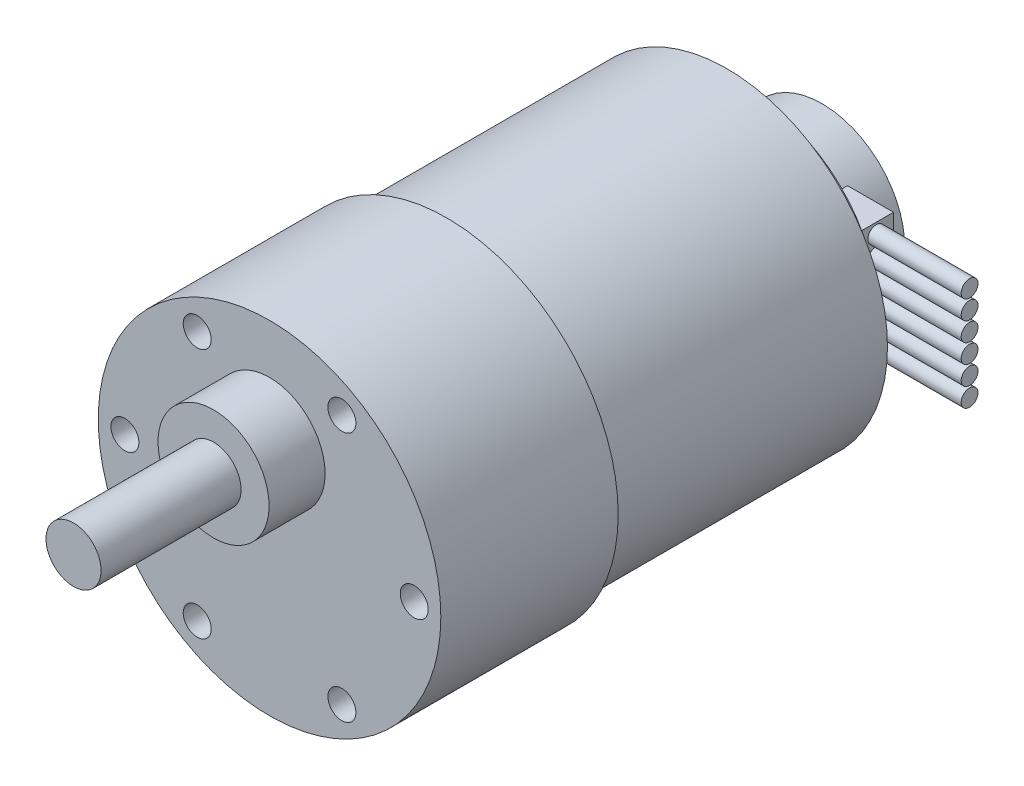
ISO-10303-21;
HEADER;
FILE_DESCRIPTION(('STEP AP214'),'2;1');
FILE_NAME('part.step','',(''),(''),'','','');
FILE_SCHEMA(('AUTOMOTIVE_DESIGN { 1 0 10303 214 1 1 1 1 }'));
ENDSEC;
DATA;
#1=APPLICATION_CONTEXT('core data for automotive mechanical design processes');
#2=APPLICATION_PROTOCOL_DEFINITION('international standard','automotive_design',2000,#1);
#3=PRODUCT_CONTEXT('',#1,'mechanical');
#4=PRODUCT('Part','Part','',(#3));
#5=PRODUCT_RELATED_PRODUCT_CATEGORY('part','',(#4));
#6=PRODUCT_DEFINITION_FORMATION('','',#4);
#7=PRODUCT_DEFINITION_CONTEXT('part definition',#1,'design');
#8=PRODUCT_DEFINITION('design','',#6,#7);
#9=PRODUCT_DEFINITION_SHAPE('','',#8);
#10=(LENGTH_UNIT() NAMED_UNIT(*) SI_UNIT(.MILLI.,.METRE.));
#11=(NAMED_UNIT(*) PLANE_ANGLE_UNIT() SI_UNIT($,.RADIAN.));
#12=(NAMED_UNIT(*) SI_UNIT($,.STERADIAN.) SOLID_ANGLE_UNIT());
#13=UNCERTAINTY_MEASURE_WITH_UNIT(LENGTH_MEASURE(1.E-05),#10,'distance_accuracy_value','');
#14=(GEOMETRIC_REPRESENTATION_CONTEXT(3) GLOBAL_UNCERTAINTY_ASSIGNED_CONTEXT((#13)) GLOBAL_UNIT_ASSIGNED_CONTEXT((#10,
#11,#12)) REPRESENTATION_CONTEXT('',''));
#15=CARTESIAN_POINT('',(0.,0.,0.));
#16=DIRECTION('',(0.,0.,1.));
#17=DIRECTION('',(1.,0.,0.));
#18=AXIS2_PLACEMENT_3D('',#15,#16,#17);
#19=CARTESIAN_POINT('',(0.,0.,-32.9));
#20=DIRECTION('',(0.,0.,-1.));
#21=DIRECTION('',(-1.,0.,0.));
#22=AXIS2_PLACEMENT_3D('',#19,#20,#21);
#23=PLANE('',#22);
#24=CARTESIAN_POINT('',(0.,0.,-32.9));
#25=DIRECTION('',(0.,0.,-1.));
#26=DIRECTION('',(-1.,0.,0.));
#27=AXIS2_PLACEMENT_3D('',#24,#25,#26);
#28=CIRCLE('',#27,13.25);
#29=CARTESIAN_POINT('',(-13.25,0.,-32.9));
#30=VERTEX_POINT('',#29);
#31=EDGE_CURVE('E129',#30,#30,#28,.T.);
#32=ORIENTED_EDGE('',*,*,#31,.T.);
#33=EDGE_LOOP('',(#32));
#34=FACE_BOUND('',#33,.T.);
#35=CARTESIAN_POINT('',(0.,0.,-32.9));
#36=DIRECTION('',(0.,0.,-1.));
#37=DIRECTION('',(-1.,0.,0.));
#38=AXIS2_PLACEMENT_3D('',#35,#36,#37);
#39=CIRCLE('',#38,8.85);
#40=CARTESIAN_POINT('',(6.31525929792277,6.2,-32.9));
#41=VERTEX_POINT('',#40);
#42=CARTESIAN_POINT('',(6.31525929792277,-6.2,-32.9));
#43=VERTEX_POINT('',#42);
#44=EDGE_CURVE('E128',#41,#43,#39,.F.);
#45=ORIENTED_EDGE('',*,*,#44,.T.);
#46=DIRECTION('',(1.,0.,0.));
#47=VECTOR('',#46,1.);
#48=CARTESIAN_POINT('',(0.,-6.2,-32.9));
#49=LINE('',#48,#47);
#50=CARTESIAN_POINT('',(11.25,-6.2,-32.9));
#51=VERTEX_POINT('',#50);
#52=EDGE_CURVE('E80',#43,#51,#49,.T.);
#53=ORIENTED_EDGE('',*,*,#52,.T.);
#54=DIRECTION('',(0.,1.,0.));
#55=VECTOR('',#54,1.);
#56=CARTESIAN_POINT('',(11.25,0.,-32.9));
#57=LINE('',#56,#55);
#58=CARTESIAN_POINT('',(11.25,6.2,-32.9));
#59=VERTEX_POINT('',#58);
#60=EDGE_CURVE('E115',#51,#59,#57,.T.);
#61=ORIENTED_EDGE('',*,*,#60,.T.);
#62=DIRECTION('',(-1.,0.,0.));
#63=VECTOR('',#62,1.);
#64=CARTESIAN_POINT('',(0.,6.2,-32.9));
#65=LINE('',#64,#63);
#66=EDGE_CURVE('E116',#59,#41,#65,.T.);
#67=ORIENTED_EDGE('',*,*,#66,.T.);
#68=EDGE_LOOP('',(#45,#53,#61,#67));
#69=FACE_BOUND('',#68,.T.);
#70=ADVANCED_FACE('F58',(#34,#69),#23,.T.);
#71=CARTESIAN_POINT('',(0.,0.,-40.2));
#72=DIRECTION('',(0.,0.,1.));
#73=DIRECTION('',(1.,0.,0.));
#74=AXIS2_PLACEMENT_3D('',#71,#72,#73);
#75=CYLINDRICAL_SURFACE('',#74,8.85);
#76=CARTESIAN_POINT('',(0.,0.,-40.2));
#77=DIRECTION('',(0.,0.,-1.));
#78=DIRECTION('',(-1.,0.,0.));
#79=AXIS2_PLACEMENT_3D('',#76,#77,#78);
#80=CIRCLE('',#79,8.85);
#81=CARTESIAN_POINT('',(-8.85,0.,-40.2));
#82=VERTEX_POINT('',#81);
#83=EDGE_CURVE('E125',#82,#82,#80,.T.);
#84=ORIENTED_EDGE('',*,*,#83,.F.);
#85=EDGE_LOOP('',(#84));
#86=FACE_BOUND('',#85,.T.);
#87=DIRECTION('',(0.,0.,1.));
#88=VECTOR('',#87,1.);
#89=CARTESIAN_POINT('',(6.31525929792277,-6.2,-40.2));
#90=LINE('',#89,#88);
#91=CARTESIAN_POINT('',(6.31525929792277,-6.2,-36.6));
#92=VERTEX_POINT('',#91);
#93=EDGE_CURVE('E100',#43,#92,#90,.F.);
#94=ORIENTED_EDGE('',*,*,#93,.F.);
#95=ORIENTED_EDGE('',*,*,#44,.F.);
#96=DIRECTION('',(0.,0.,1.));
#97=VECTOR('',#96,1.);
#98=CARTESIAN_POINT('',(6.31525929792277,6.2,-40.2));
#99=LINE('',#98,#97);
#100=CARTESIAN_POINT('',(6.31525929792277,6.2,-36.6));
#101=VERTEX_POINT('',#100);
#102=EDGE_CURVE('E199',#101,#41,#99,.T.);
#103=ORIENTED_EDGE('',*,*,#102,.F.);
#104=CARTESIAN_POINT('',(0.,0.,-36.6));
#105=DIRECTION('',(0.,0.,-1.));
#106=DIRECTION('',(-1.,0.,0.));
#107=AXIS2_PLACEMENT_3D('',#104,#105,#106);
#108=CIRCLE('',#107,8.85);
#109=EDGE_CURVE('E136',#101,#92,#108,.T.);
#110=ORIENTED_EDGE('',*,*,#109,.T.);
#111=EDGE_LOOP('',(#94,#95,#103,#110));
#112=FACE_BOUND('',#111,.T.);
#113=ADVANCED_FACE('F248',(#86,#112),#75,.T.);
#114=CARTESIAN_POINT('',(0.,0.,0.));
#115=DIRECTION('',(0.,0.,1.));
#116=DIRECTION('',(1.,0.,0.));
#117=AXIS2_PLACEMENT_3D('',#114,#115,#116);
#118=PLANE('',#117);
#119=CARTESIAN_POINT('',(0.,0.,0.));
#120=DIRECTION('',(0.,0.,1.));
#121=DIRECTION('',(1.,0.,0.));
#122=AXIS2_PLACEMENT_3D('',#119,#120,#121);
#123=CIRCLE('',#122,17.2);
#124=CARTESIAN_POINT('',(17.2,0.,0.));
#125=VERTEX_POINT('',#124);
#126=EDGE_CURVE('E181',#125,#125,#123,.T.);
#127=ORIENTED_EDGE('',*,*,#126,.T.);
#128=EDGE_LOOP('',(#127));
#129=FACE_BOUND('',#128,.T.);
#130=CARTESIAN_POINT('',(0.,0.,0.));
#131=DIRECTION('',(0.,0.,1.));
#132=DIRECTION('',(1.,0.,0.));
#133=AXIS2_PLACEMENT_3D('',#130,#131,#132);
#134=CIRCLE('',#133,18.35);
#135=CARTESIAN_POINT('',(18.35,0.,0.));
#136=VERTEX_POINT('',#135);
#137=EDGE_CURVE('E187',#136,#136,#134,.T.);
#138=ORIENTED_EDGE('',*,*,#137,.F.);
#139=EDGE_LOOP('',(#138));
#140=FACE_BOUND('',#139,.T.);
#141=ADVANCED_FACE('F254',(#129,#140),#118,.F.);
#142=CARTESIAN_POINT('',(0.,0.,19.));
#143=DIRECTION('',(0.,0.,-1.));
#144=DIRECTION('',(-1.,0.,0.));
#145=AXIS2_PLACEMENT_3D('',#142,#143,#144);
#146=CYLINDRICAL_SURFACE('',#145,18.35);
#147=CARTESIAN_POINT('',(0.,0.,19.));
#148=DIRECTION('',(0.,0.,1.));
#149=DIRECTION('',(1.,0.,0.));
#150=AXIS2_PLACEMENT_3D('',#147,#148,#149);
#151=CIRCLE('',#150,18.35);
#152=CARTESIAN_POINT('',(18.35,0.,19.));
#153=VERTEX_POINT('',#152);
#154=EDGE_CURVE('E137',#153,#153,#151,.T.);
#155=ORIENTED_EDGE('',*,*,#154,.F.);
#156=EDGE_LOOP('',(#155));
#157=FACE_BOUND('',#156,.T.);
#158=ORIENTED_EDGE('',*,*,#137,.T.);
#159=EDGE_LOOP('',(#158));
#160=FACE_BOUND('',#159,.T.);
#161=ADVANCED_FACE('F60',(#157,#160),#146,.T.);
#162=CARTESIAN_POINT('',(0.,0.,19.));
#163=DIRECTION('',(0.,0.,1.));
#164=DIRECTION('',(1.,0.,0.));
#165=AXIS2_PLACEMENT_3D('',#162,#163,#164);
#166=PLANE('',#165);
#167=CARTESIAN_POINT('',(0.,7.1,19.));
#168=DIRECTION('',(0.,0.,1.));
#169=DIRECTION('',(1.,0.,0.));
#170=AXIS2_PLACEMENT_3D('',#167,#168,#169);
#171=CIRCLE('',#170,5.95);
#172=CARTESIAN_POINT('',(5.95,7.1,19.));
#173=VERTEX_POINT('',#172);
#174=EDGE_CURVE('E145',#173,#173,#171,.T.);
#175=ORIENTED_EDGE('',*,*,#174,.F.);
#176=EDGE_LOOP('',(#175));
#177=FACE_BOUND('',#176,.T.);
#178=CARTESIAN_POINT('',(-15.5,0.,19.));
#179=DIRECTION('',(0.,0.,1.));
#180=DIRECTION('',(1.,0.,0.));
#181=AXIS2_PLACEMENT_3D('',#178,#179,#180);
#182=CIRCLE('',#181,1.5);
#183=CARTESIAN_POINT('',(-14.,0.,19.));
#184=VERTEX_POINT('',#183);
#185=EDGE_CURVE('E144',#184,#184,#182,.T.);
#186=ORIENTED_EDGE('',*,*,#185,.F.);
#187=EDGE_LOOP('',(#186));
#188=FACE_BOUND('',#187,.T.);
#189=CARTESIAN_POINT('',(-7.75,-13.4233937586588,19.));
#190=DIRECTION('',(0.,0.,1.));
#191=DIRECTION('',(1.,0.,0.));
#192=AXIS2_PLACEMENT_3D('',#189,#190,#191);
#193=CIRCLE('',#192,1.5);
#194=CARTESIAN_POINT('',(-6.25,-13.4233937586588,19.));
#195=VERTEX_POINT('',#194);
#196=EDGE_CURVE('E170',#195,#195,#193,.T.);
#197=ORIENTED_EDGE('',*,*,#196,.F.);
#198=EDGE_LOOP('',(#197));
#199=FACE_BOUND('',#198,.T.);
#200=CARTESIAN_POINT('',(7.75,-13.4233937586588,19.));
#201=DIRECTION('',(0.,0.,1.));
#202=DIRECTION('',(1.,0.,0.));
#203=AXIS2_PLACEMENT_3D('',#200,#201,#202);
#204=CIRCLE('',#203,1.5);
#205=CARTESIAN_POINT('',(9.25000000000001,-13.4233937586588,19.));
#206=VERTEX_POINT('',#205);
#207=EDGE_CURVE('E164',#206,#206,#204,.T.);
#208=ORIENTED_EDGE('',*,*,#207,.F.);
#209=EDGE_LOOP('',(#208));
#210=FACE_BOUND('',#209,.T.);
#211=CARTESIAN_POINT('',(15.5,0.,19.));
#212=DIRECTION('',(0.,0.,1.));
#213=DIRECTION('',(1.,0.,0.));
#214=AXIS2_PLACEMENT_3D('',#211,#212,#213);
#215=CIRCLE('',#214,1.5);
#216=CARTESIAN_POINT('',(17.,0.,19.));
#217=VERTEX_POINT('',#216);
#218=EDGE_CURVE('E158',#217,#217,#215,.T.);
#219=ORIENTED_EDGE('',*,*,#218,.F.);
#220=EDGE_LOOP('',(#219));
#221=FACE_BOUND('',#220,.T.);
#222=CARTESIAN_POINT('',(7.74999999999999,13.4233937586588,19.));
#223=DIRECTION('',(0.,0.,1.));
#224=DIRECTION('',(1.,0.,0.));
#225=AXIS2_PLACEMENT_3D('',#222,#223,#224);
#226=CIRCLE('',#225,1.5);
#227=CARTESIAN_POINT('',(9.24999999999999,13.4233937586588,19.));
#228=VERTEX_POINT('',#227);
#229=EDGE_CURVE('E152',#228,#228,#226,.T.);
#230=ORIENTED_EDGE('',*,*,#229,.F.);
#231=EDGE_LOOP('',(#230));
#232=FACE_BOUND('',#231,.T.);
#233=CARTESIAN_POINT('',(-7.75000000000001,13.4233937586588,19.));
#234=DIRECTION('',(0.,0.,1.));
#235=DIRECTION('',(1.,0.,0.));
#236=AXIS2_PLACEMENT_3D('',#233,#234,#235);
#237=CIRCLE('',#236,1.5);
#238=CARTESIAN_POINT('',(-6.25000000000001,13.4233937586588,19.));
#239=VERTEX_POINT('',#238);
#240=EDGE_CURVE('E151',#239,#239,#237,.T.);
#241=ORIENTED_EDGE('',*,*,#240,.F.);
#242=EDGE_LOOP('',(#241));
#243=FACE_BOUND('',#242,.T.);
#244=ORIENTED_EDGE('',*,*,#154,.T.);
#245=EDGE_LOOP('',(#244));
#246=FACE_BOUND('',#245,.T.);
#247=ADVANCED_FACE('F335',(#177,#188,#199,#210,#221,#232,#243,#246),#166,.T.);
#248=CARTESIAN_POINT('',(0.,0.,-30.));
#249=DIRECTION('',(0.,0.,1.));
#250=DIRECTION('',(1.,0.,0.));
#251=AXIS2_PLACEMENT_3D('',#248,#249,#250);
#252=CYLINDRICAL_SURFACE('',#251,17.2);
#253=CARTESIAN_POINT('',(0.,0.,-30.));
#254=DIRECTION('',(0.,0.,1.));
#255=DIRECTION('',(1.,0.,0.));
#256=AXIS2_PLACEMENT_3D('',#253,#254,#255);
#257=CIRCLE('',#256,17.2);
#258=CARTESIAN_POINT('',(17.2,0.,-30.));
#259=VERTEX_POINT('',#258);
#260=EDGE_CURVE('E184',#259,#259,#257,.T.);
#261=ORIENTED_EDGE('',*,*,#260,.T.);
#262=EDGE_LOOP('',(#261));
#263=FACE_BOUND('',#262,.T.);
#264=ORIENTED_EDGE('',*,*,#126,.F.);
#265=EDGE_LOOP('',(#264));
#266=FACE_BOUND('',#265,.T.);
#267=ADVANCED_FACE('F331',(#263,#266),#252,.T.);
#268=CARTESIAN_POINT('',(0.,0.,-30.));
#269=DIRECTION('',(0.,0.,1.));
#270=DIRECTION('',(1.,0.,0.));
#271=AXIS2_PLACEMENT_3D('',#268,#269,#270);
#272=PLANE('',#271);
#273=CARTESIAN_POINT('',(0.,0.,-30.));
#274=DIRECTION('',(0.,0.,-1.));
#275=DIRECTION('',(-1.,0.,0.));
#276=AXIS2_PLACEMENT_3D('',#273,#274,#275);
#277=CIRCLE('',#276,13.25);
#278=CARTESIAN_POINT('',(-13.25,0.,-30.));
#279=VERTEX_POINT('',#278);
#280=EDGE_CURVE('E133',#279,#279,#277,.T.);
#281=ORIENTED_EDGE('',*,*,#280,.F.);
#282=EDGE_LOOP('',(#281));
#283=FACE_BOUND('',#282,.T.);
#284=ORIENTED_EDGE('',*,*,#260,.F.);
#285=EDGE_LOOP('',(#284));
#286=FACE_BOUND('',#285,.T.);
#287=ADVANCED_FACE('F327',(#283,#286),#272,.F.);
#288=CARTESIAN_POINT('',(-7.75000000000001,13.4233937586588,14.));
#289=DIRECTION('',(0.,0.,1.));
#290=DIRECTION('',(1.,0.,0.));
#291=AXIS2_PLACEMENT_3D('',#288,#289,#290);
#292=CYLINDRICAL_SURFACE('',#291,1.5);
#293=CARTESIAN_POINT('',(-7.75000000000001,13.4233937586588,14.));
#294=DIRECTION('',(0.,0.,1.));
#295=DIRECTION('',(1.,0.,0.));
#296=AXIS2_PLACEMENT_3D('',#293,#294,#295);
#297=CIRCLE('',#296,1.5);
#298=CARTESIAN_POINT('',(-6.25000000000001,13.4233937586588,14.));
#299=VERTEX_POINT('',#298);
#300=EDGE_CURVE('E178',#299,#299,#297,.T.);
#301=ORIENTED_EDGE('',*,*,#300,.F.);
#302=EDGE_LOOP('',(#301));
#303=FACE_BOUND('',#302,.T.);
#304=ORIENTED_EDGE('',*,*,#240,.T.);
#305=EDGE_LOOP('',(#304));
#306=FACE_BOUND('',#305,.T.);
#307=ADVANCED_FACE('F323',(#303,#306),#292,.F.);
#308=CARTESIAN_POINT('',(0.,0.,14.));
#309=DIRECTION('',(0.,0.,1.));
#310=DIRECTION('',(1.,0.,0.));
#311=AXIS2_PLACEMENT_3D('',#308,#309,#310);
#312=PLANE('',#311);
#313=ORIENTED_EDGE('',*,*,#300,.T.);
#314=EDGE_LOOP('',(#313));
#315=FACE_BOUND('',#314,.T.);
#316=ADVANCED_FACE('F289',(#315),#312,.T.);
#317=CARTESIAN_POINT('',(7.74999999999999,13.4233937586588,14.));
#318=DIRECTION('',(0.,0.,1.));
#319=DIRECTION('',(1.,0.,0.));
#320=AXIS2_PLACEMENT_3D('',#317,#318,#319);
#321=CYLINDRICAL_SURFACE('',#320,1.5);
#322=CARTESIAN_POINT('',(7.74999999999999,13.4233937586588,14.));
#323=DIRECTION('',(0.,0.,1.));
#324=DIRECTION('',(1.,0.,0.));
#325=AXIS2_PLACEMENT_3D('',#322,#323,#324);
#326=CIRCLE('',#325,1.5);
#327=CARTESIAN_POINT('',(9.24999999999999,13.4233937586588,14.));
#328=VERTEX_POINT('',#327);
#329=EDGE_CURVE('E148',#328,#328,#326,.T.);
#330=ORIENTED_EDGE('',*,*,#329,.F.);
#331=EDGE_LOOP('',(#330));
#332=FACE_BOUND('',#331,.T.);
#333=ORIENTED_EDGE('',*,*,#229,.T.);
#334=EDGE_LOOP('',(#333));
#335=FACE_BOUND('',#334,.T.);
#336=ADVANCED_FACE('F285',(#332,#335),#321,.F.);
#337=CARTESIAN_POINT('',(0.,0.,14.));
#338=DIRECTION('',(0.,0.,1.));
#339=DIRECTION('',(1.,0.,0.));
#340=AXIS2_PLACEMENT_3D('',#337,#338,#339);
#341=PLANE('',#340);
#342=ORIENTED_EDGE('',*,*,#329,.T.);
#343=EDGE_LOOP('',(#342));
#344=FACE_BOUND('',#343,.T.);
#345=ADVANCED_FACE('F281',(#344),#341,.T.);
#346=CARTESIAN_POINT('',(15.5,0.,14.));
#347=DIRECTION('',(0.,0.,1.));
#348=DIRECTION('',(1.,0.,0.));
#349=AXIS2_PLACEMENT_3D('',#346,#347,#348);
#350=CYLINDRICAL_SURFACE('',#349,1.5);
#351=CARTESIAN_POINT('',(15.5,0.,14.));
#352=DIRECTION('',(0.,0.,1.));
#353=DIRECTION('',(1.,0.,0.));
#354=AXIS2_PLACEMENT_3D('',#351,#352,#353);
#355=CIRCLE('',#354,1.5);
#356=CARTESIAN_POINT('',(17.,0.,14.));
#357=VERTEX_POINT('',#356);
#358=EDGE_CURVE('E155',#357,#357,#355,.T.);
#359=ORIENTED_EDGE('',*,*,#358,.F.);
#360=EDGE_LOOP('',(#359));
#361=FACE_BOUND('',#360,.T.);
#362=ORIENTED_EDGE('',*,*,#218,.T.);
#363=EDGE_LOOP('',(#362));
#364=FACE_BOUND('',#363,.T.);
#365=ADVANCED_FACE('F284',(#361,#364),#350,.F.);
#366=CARTESIAN_POINT('',(0.,0.,14.));
#367=DIRECTION('',(0.,0.,1.));
#368=DIRECTION('',(1.,0.,0.));
#369=AXIS2_PLACEMENT_3D('',#366,#367,#368);
#370=PLANE('',#369);
#371=ORIENTED_EDGE('',*,*,#358,.T.);
#372=EDGE_LOOP('',(#371));
#373=FACE_BOUND('',#372,.T.);
#374=ADVANCED_FACE('F291',(#373),#370,.T.);
#375=CARTESIAN_POINT('',(7.75,-13.4233937586588,14.));
#376=DIRECTION('',(0.,0.,1.));
#377=DIRECTION('',(1.,0.,0.));
#378=AXIS2_PLACEMENT_3D('',#375,#376,#377);
#379=CYLINDRICAL_SURFACE('',#378,1.5);
#380=CARTESIAN_POINT('',(7.75,-13.4233937586588,14.));
#381=DIRECTION('',(0.,0.,1.));
#382=DIRECTION('',(1.,0.,0.));
#383=AXIS2_PLACEMENT_3D('',#380,#381,#382);
#384=CIRCLE('',#383,1.5);
#385=CARTESIAN_POINT('',(9.25000000000001,-13.4233937586588,14.));
#386=VERTEX_POINT('',#385);
#387=EDGE_CURVE('E161',#386,#386,#384,.T.);
#388=ORIENTED_EDGE('',*,*,#387,.F.);
#389=EDGE_LOOP('',(#388));
#390=FACE_BOUND('',#389,.T.);
#391=ORIENTED_EDGE('',*,*,#207,.T.);
#392=EDGE_LOOP('',(#391));
#393=FACE_BOUND('',#392,.T.);
#394=ADVANCED_FACE('F294',(#390,#393),#379,.F.);
#395=CARTESIAN_POINT('',(0.,0.,14.));
#396=DIRECTION('',(0.,0.,1.));
#397=DIRECTION('',(1.,0.,0.));
#398=AXIS2_PLACEMENT_3D('',#395,#396,#397);
#399=PLANE('',#398);
#400=ORIENTED_EDGE('',*,*,#387,.T.);
#401=EDGE_LOOP('',(#400));
#402=FACE_BOUND('',#401,.T.);
#403=ADVANCED_FACE('F299',(#402),#399,.T.);
#404=CARTESIAN_POINT('',(-7.75,-13.4233937586588,14.));
#405=DIRECTION('',(0.,0.,1.));
#406=DIRECTION('',(1.,0.,0.));
#407=AXIS2_PLACEMENT_3D('',#404,#405,#406);
#408=CYLINDRICAL_SURFACE('',#407,1.5);
#409=CARTESIAN_POINT('',(-7.75,-13.4233937586588,14.));
#410=DIRECTION('',(0.,0.,1.));
#411=DIRECTION('',(1.,0.,0.));
#412=AXIS2_PLACEMENT_3D('',#409,#410,#411);
#413=CIRCLE('',#412,1.5);
#414=CARTESIAN_POINT('',(-6.25,-13.4233937586588,14.));
#415=VERTEX_POINT('',#414);
#416=EDGE_CURVE('E167',#415,#415,#413,.T.);
#417=ORIENTED_EDGE('',*,*,#416,.F.);
#418=EDGE_LOOP('',(#417));
#419=FACE_BOUND('',#418,.T.);
#420=ORIENTED_EDGE('',*,*,#196,.T.);
#421=EDGE_LOOP('',(#420));
#422=FACE_BOUND('',#421,.T.);
#423=ADVANCED_FACE('F302',(#419,#422),#408,.F.);
#424=CARTESIAN_POINT('',(0.,0.,14.));
#425=DIRECTION('',(0.,0.,1.));
#426=DIRECTION('',(1.,0.,0.));
#427=AXIS2_PLACEMENT_3D('',#424,#425,#426);
#428=PLANE('',#427);
#429=ORIENTED_EDGE('',*,*,#416,.T.);
#430=EDGE_LOOP('',(#429));
#431=FACE_BOUND('',#430,.T.);
#432=ADVANCED_FACE('F307',(#431),#428,.T.);
#433=CARTESIAN_POINT('',(-15.5,0.,14.));
#434=DIRECTION('',(0.,0.,1.));
#435=DIRECTION('',(1.,0.,0.));
#436=AXIS2_PLACEMENT_3D('',#433,#434,#435);
#437=CYLINDRICAL_SURFACE('',#436,1.5);
#438=CARTESIAN_POINT('',(-15.5,0.,14.));
#439=DIRECTION('',(0.,0.,1.));
#440=DIRECTION('',(1.,0.,0.));
#441=AXIS2_PLACEMENT_3D('',#438,#439,#440);
#442=CIRCLE('',#441,1.5);
#443=CARTESIAN_POINT('',(-14.,0.,14.));
#444=VERTEX_POINT('',#443);
#445=EDGE_CURVE('E173',#444,#444,#442,.T.);
#446=ORIENTED_EDGE('',*,*,#445,.F.);
#447=EDGE_LOOP('',(#446));
#448=FACE_BOUND('',#447,.T.);
#449=ORIENTED_EDGE('',*,*,#185,.T.);
#450=EDGE_LOOP('',(#449));
#451=FACE_BOUND('',#450,.T.);
#452=ADVANCED_FACE('F310',(#448,#451),#437,.F.);
#453=CARTESIAN_POINT('',(0.,0.,14.));
#454=DIRECTION('',(0.,0.,1.));
#455=DIRECTION('',(1.,0.,0.));
#456=AXIS2_PLACEMENT_3D('',#453,#454,#455);
#457=PLANE('',#456);
#458=ORIENTED_EDGE('',*,*,#445,.T.);
#459=EDGE_LOOP('',(#458));
#460=FACE_BOUND('',#459,.T.);
#461=ADVANCED_FACE('F279',(#460),#457,.T.);
#462=CARTESIAN_POINT('',(0.,7.1,25.));
#463=DIRECTION('',(0.,0.,-1.));
#464=DIRECTION('',(-1.,0.,0.));
#465=AXIS2_PLACEMENT_3D('',#462,#463,#464);
#466=CYLINDRICAL_SURFACE('',#465,5.95);
#467=CARTESIAN_POINT('',(0.,7.1,25.));
#468=DIRECTION('',(0.,0.,1.));
#469=DIRECTION('',(1.,0.,0.));
#470=AXIS2_PLACEMENT_3D('',#467,#468,#469);
#471=CIRCLE('',#470,5.95);
#472=CARTESIAN_POINT('',(5.95,7.1,25.));
#473=VERTEX_POINT('',#472);
#474=EDGE_CURVE('E141',#473,#473,#471,.T.);
#475=ORIENTED_EDGE('',*,*,#474,.F.);
#476=EDGE_LOOP('',(#475));
#477=FACE_BOUND('',#476,.T.);
#478=ORIENTED_EDGE('',*,*,#174,.T.);
#479=EDGE_LOOP('',(#478));
#480=FACE_BOUND('',#479,.T.);
#481=ADVANCED_FACE('F275',(#477,#480),#466,.T.);
#482=CARTESIAN_POINT('',(0.,0.,25.));
#483=DIRECTION('',(0.,0.,1.));
#484=DIRECTION('',(1.,0.,0.));
#485=AXIS2_PLACEMENT_3D('',#482,#483,#484);
#486=PLANE('',#485);
#487=CARTESIAN_POINT('',(0.,7.1,25.));
#488=DIRECTION('',(0.,0.,1.));
#489=DIRECTION('',(1.,0.,0.));
#490=AXIS2_PLACEMENT_3D('',#487,#488,#489);
#491=CIRCLE('',#490,2.95);
#492=CARTESIAN_POINT('',(-2.95,7.1,25.));
#493=VERTEX_POINT('',#492);
#494=EDGE_CURVE('E140',#493,#493,#491,.F.);
#495=ORIENTED_EDGE('',*,*,#494,.T.);
#496=EDGE_LOOP('',(#495));
#497=FACE_BOUND('',#496,.T.);
#498=ORIENTED_EDGE('',*,*,#474,.T.);
#499=EDGE_LOOP('',(#498));
#500=FACE_BOUND('',#499,.T.);
#501=ADVANCED_FACE('F271',(#497,#500),#486,.T.);
#502=CARTESIAN_POINT('',(0.,7.1,40.));
#503=DIRECTION('',(0.,0.,-1.));
#504=DIRECTION('',(-1.,0.,0.));
#505=AXIS2_PLACEMENT_3D('',#502,#503,#504);
#506=CYLINDRICAL_SURFACE('',#505,2.95);
#507=CARTESIAN_POINT('',(0.,7.1,40.));
#508=DIRECTION('',(0.,0.,1.));
#509=DIRECTION('',(1.,0.,0.));
#510=AXIS2_PLACEMENT_3D('',#507,#508,#509);
#511=CIRCLE('',#510,2.95);
#512=CARTESIAN_POINT('',(-2.95,7.1,40.));
#513=VERTEX_POINT('',#512);
#514=EDGE_CURVE('E132',#513,#513,#511,.T.);
#515=CARTESIAN_POINT('',(-2.95,7.1,25.));
#516=CARTESIAN_POINT('',(-2.95,7.1,25.15625));
#517=CARTESIAN_POINT('',(-2.95,7.1,25.3125));
#518=CARTESIAN_POINT('',(-2.95,7.1,25.625));
#519=CARTESIAN_POINT('',(-2.95,7.1,25.78125));
#520=CARTESIAN_POINT('',(-2.95,7.1,26.09375));
#521=CARTESIAN_POINT('',(-2.95,7.1,26.25));
#522=CARTESIAN_POINT('',(-2.95,7.1,26.5625));
#523=CARTESIAN_POINT('',(-2.95,7.1,26.71875));
#524=CARTESIAN_POINT('',(-2.95,7.1,27.03125));
#525=CARTESIAN_POINT('',(-2.95,7.1,27.1875));
#526=CARTESIAN_POINT('',(-2.95,7.1,27.5));
#527=CARTESIAN_POINT('',(-2.95,7.1,27.65625));
#528=CARTESIAN_POINT('',(-2.95,7.1,27.96875));
#529=CARTESIAN_POINT('',(-2.95,7.1,28.125));
#530=CARTESIAN_POINT('',(-2.95,7.1,28.4375));
#531=CARTESIAN_POINT('',(-2.95,7.1,28.59375));
#532=CARTESIAN_POINT('',(-2.95,7.1,28.90625));
#533=CARTESIAN_POINT('',(-2.95,7.1,29.0625));
#534=CARTESIAN_POINT('',(-2.95,7.1,29.375));
#535=CARTESIAN_POINT('',(-2.95,7.1,29.53125));
#536=CARTESIAN_POINT('',(-2.95,7.1,29.84375));
#537=CARTESIAN_POINT('',(-2.95,7.1,30.));
#538=CARTESIAN_POINT('',(-2.95,7.1,30.3125));
#539=CARTESIAN_POINT('',(-2.95,7.1,30.46875));
#540=CARTESIAN_POINT('',(-2.95,7.1,30.78125));
#541=CARTESIAN_POINT('',(-2.95,7.1,30.9375));
#542=CARTESIAN_POINT('',(-2.95,7.1,31.25));
#543=CARTESIAN_POINT('',(-2.95,7.1,31.40625));
#544=CARTESIAN_POINT('',(-2.95,7.1,31.71875));
#545=CARTESIAN_POINT('',(-2.95,7.1,31.875));
#546=CARTESIAN_POINT('',(-2.95,7.1,32.1875));
#547=CARTESIAN_POINT('',(-2.95,7.1,32.34375));
#548=CARTESIAN_POINT('',(-2.95,7.1,32.65625));
#549=CARTESIAN_POINT('',(-2.95,7.1,32.8125));
#550=CARTESIAN_POINT('',(-2.95,7.1,33.125));
#551=CARTESIAN_POINT('',(-2.95,7.1,33.28125));
#552=CARTESIAN_POINT('',(-2.95,7.1,33.59375));
#553=CARTESIAN_POINT('',(-2.95,7.1,33.75));
#554=CARTESIAN_POINT('',(-2.95,7.1,34.0625));
#555=CARTESIAN_POINT('',(-2.95,7.1,34.21875));
#556=CARTESIAN_POINT('',(-2.95,7.1,34.53125));
#557=CARTESIAN_POINT('',(-2.95,7.1,34.6875));
#558=CARTESIAN_POINT('',(-2.95,7.1,35.));
#559=CARTESIAN_POINT('',(-2.95,7.1,35.15625));
#560=CARTESIAN_POINT('',(-2.95,7.1,35.46875));
#561=CARTESIAN_POINT('',(-2.95,7.1,35.625));
#562=CARTESIAN_POINT('',(-2.95,7.1,35.9375));
#563=CARTESIAN_POINT('',(-2.95,7.1,36.09375));
#564=CARTESIAN_POINT('',(-2.95,7.1,36.40625));
#565=CARTESIAN_POINT('',(-2.95,7.1,36.5625));
#566=CARTESIAN_POINT('',(-2.95,7.1,36.875));
#567=CARTESIAN_POINT('',(-2.95,7.1,37.03125));
#568=CARTESIAN_POINT('',(-2.95,7.1,37.34375));
#569=CARTESIAN_POINT('',(-2.95,7.1,37.5));
#570=CARTESIAN_POINT('',(-2.95,7.1,37.8125));
#571=CARTESIAN_POINT('',(-2.95,7.1,37.96875));
#572=CARTESIAN_POINT('',(-2.95,7.1,38.28125));
#573=CARTESIAN_POINT('',(-2.95,7.1,38.4375));
#574=CARTESIAN_POINT('',(-2.95,7.1,38.75));
#575=CARTESIAN_POINT('',(-2.95,7.1,38.90625));
#576=CARTESIAN_POINT('',(-2.95,7.1,39.21875));
#577=CARTESIAN_POINT('',(-2.95,7.1,39.375));
#578=CARTESIAN_POINT('',(-2.95,7.1,39.6875));
#579=CARTESIAN_POINT('',(-2.95,7.1,39.84375));
#580=CARTESIAN_POINT('',(-2.95,7.1,40.));
#581=B_SPLINE_CURVE_WITH_KNOTS('',3,(#515,#516,#517,#518,#519,#520,#521,#522,#523,#524,#525,
#526,#527,#528,#529,#530,#531,#532,#533,#534,#535,#536,#537,#538,#539,#540,#541,#542,#543,#544,
#545,#546,#547,#548,#549,#550,#551,#552,#553,#554,#555,#556,#557,#558,#559,#560,#561,#562,#563,
#564,#565,#566,#567,#568,#569,#570,#571,#572,#573,#574,#575,#576,#577,#578,#579,#580),
.UNSPECIFIED.,.F.,.F.,(4,2,2,2,2,2,2,2,2,2,2,2,2,2,2,2,2,2,2,2,2,2,2,2,2,2,2,2,2,2,2,2,4),(0.,
0.468749999999997,0.937500000000001,1.40625,1.875,2.34375,2.8125,3.28125,3.75,4.21875,4.6875,
5.15625,5.625,6.09375,6.5625,7.03125,7.5,7.96875,8.4375,8.90625,9.37499999999999,9.84375,
10.3125,10.78125,11.25,11.71875,12.1875,12.65625,13.125,13.59375,14.0625,14.53125,15.),.UNSPECIFIED.);
#582=EDGE_CURVE('BSEAM267',#493,#513,#581,.T.);
#583=ORIENTED_EDGE('',*,*,#494,.F.);
#584=ORIENTED_EDGE('',*,*,#514,.F.);
#585=ORIENTED_EDGE('',*,*,#582,.T.);
#586=ORIENTED_EDGE('',*,*,#582,.F.);
#587=EDGE_LOOP('',(#583,#585,#584,#586));
#588=FACE_BOUND('',#587,.T.);
#589=ADVANCED_FACE('F267',(#588),#506,.T.);
#590=CARTESIAN_POINT('',(0.,0.,40.));
#591=DIRECTION('',(0.,0.,1.));
#592=DIRECTION('',(1.,0.,0.));
#593=AXIS2_PLACEMENT_3D('',#590,#591,#592);
#594=PLANE('',#593);
#595=ORIENTED_EDGE('',*,*,#514,.T.);
#596=EDGE_LOOP('',(#595));
#597=FACE_BOUND('',#596,.T.);
#598=ADVANCED_FACE('F263',(#597),#594,.T.);
#599=CARTESIAN_POINT('',(0.,0.,-32.9));
#600=DIRECTION('',(0.,0.,1.));
#601=DIRECTION('',(1.,0.,0.));
#602=AXIS2_PLACEMENT_3D('',#599,#600,#601);
#603=CYLINDRICAL_SURFACE('',#602,13.25);
#604=ORIENTED_EDGE('',*,*,#31,.F.);
#605=EDGE_LOOP('',(#604));
#606=FACE_BOUND('',#605,.T.);
#607=ORIENTED_EDGE('',*,*,#280,.T.);
#608=EDGE_LOOP('',(#607));
#609=FACE_BOUND('',#608,.T.);
#610=ADVANCED_FACE('F260',(#606,#609),#603,.T.);
#611=CARTESIAN_POINT('',(0.,0.,-40.2));
#612=DIRECTION('',(0.,0.,-1.));
#613=DIRECTION('',(-1.,0.,0.));
#614=AXIS2_PLACEMENT_3D('',#611,#612,#613);
#615=PLANE('',#614);
#616=ORIENTED_EDGE('',*,*,#83,.T.);
#617=EDGE_LOOP('',(#616));
#618=FACE_BOUND('',#617,.T.);
#619=ADVANCED_FACE('F221',(#618),#615,.T.);
#620=CARTESIAN_POINT('',(11.25,-6.2,-36.6));
#621=DIRECTION('',(-1.,0.,0.));
#622=DIRECTION('',(0.,-1.,0.));
#623=AXIS2_PLACEMENT_3D('',#620,#621,#622);
#624=PLANE('',#623);
#625=CARTESIAN_POINT('',(11.25,-5.07142857142857,-34.75));
#626=DIRECTION('',(-1.,0.,0.));
#627=DIRECTION('',(0.,-1.,0.));
#628=AXIS2_PLACEMENT_3D('',#625,#626,#627);
#629=CIRCLE('',#628,0.899999999999997);
#630=CARTESIAN_POINT('',(11.25,-5.97142857142857,-34.75));
#631=VERTEX_POINT('',#630);
#632=EDGE_CURVE('E12',#631,#631,#629,.F.);
#633=ORIENTED_EDGE('',*,*,#632,.F.);
#634=EDGE_LOOP('',(#633));
#635=FACE_BOUND('',#634,.T.);
#636=CARTESIAN_POINT('',(11.25,-3.04285714285714,-34.75));
#637=DIRECTION('',(-1.,0.,0.));
#638=DIRECTION('',(0.,-1.,0.));
#639=AXIS2_PLACEMENT_3D('',#636,#637,#638);
#640=CIRCLE('',#639,0.899999999999997);
#641=CARTESIAN_POINT('',(11.25,-3.94285714285714,-34.75));
#642=VERTEX_POINT('',#641);
#643=EDGE_CURVE('E66',#642,#642,#640,.F.);
#644=ORIENTED_EDGE('',*,*,#643,.F.);
#645=EDGE_LOOP('',(#644));
#646=FACE_BOUND('',#645,.T.);
#647=CARTESIAN_POINT('',(11.25,-1.01428571428571,-34.75));
#648=DIRECTION('',(-1.,0.,0.));
#649=DIRECTION('',(0.,-1.,0.));
#650=AXIS2_PLACEMENT_3D('',#647,#648,#649);
#651=CIRCLE('',#650,0.899999999999997);
#652=CARTESIAN_POINT('',(11.25,-1.91428571428571,-34.75));
#653=VERTEX_POINT('',#652);
#654=EDGE_CURVE('E212',#653,#653,#651,.F.);
#655=ORIENTED_EDGE('',*,*,#654,.F.);
#656=EDGE_LOOP('',(#655));
#657=FACE_BOUND('',#656,.T.);
#658=CARTESIAN_POINT('',(11.25,1.01428571428571,-34.75));
#659=DIRECTION('',(-1.,0.,0.));
#660=DIRECTION('',(0.,-1.,0.));
#661=AXIS2_PLACEMENT_3D('',#658,#659,#660);
#662=CIRCLE('',#661,0.899999999999997);
#663=CARTESIAN_POINT('',(11.25,0.114285714285717,-34.75));
#664=VERTEX_POINT('',#663);
#665=EDGE_CURVE('E209',#664,#664,#662,.F.);
#666=ORIENTED_EDGE('',*,*,#665,.F.);
#667=EDGE_LOOP('',(#666));
#668=FACE_BOUND('',#667,.T.);
#669=CARTESIAN_POINT('',(11.25,3.04285714285714,-34.75));
#670=DIRECTION('',(-1.,0.,0.));
#671=DIRECTION('',(0.,-1.,0.));
#672=AXIS2_PLACEMENT_3D('',#669,#670,#671);
#673=CIRCLE('',#672,0.899999999999997);
#674=CARTESIAN_POINT('',(11.25,2.14285714285715,-34.75));
#675=VERTEX_POINT('',#674);
#676=EDGE_CURVE('E206',#675,#675,#673,.F.);
#677=ORIENTED_EDGE('',*,*,#676,.F.);
#678=EDGE_LOOP('',(#677));
#679=FACE_BOUND('',#678,.T.);
#680=CARTESIAN_POINT('',(11.25,5.07142857142857,-34.75));
#681=DIRECTION('',(-1.,0.,0.));
#682=DIRECTION('',(0.,-1.,0.));
#683=AXIS2_PLACEMENT_3D('',#680,#681,#682);
#684=CIRCLE('',#683,0.899999999999997);
#685=CARTESIAN_POINT('',(11.25,4.17142857142857,-34.75));
#686=VERTEX_POINT('',#685);
#687=EDGE_CURVE('E203',#686,#686,#684,.F.);
#688=ORIENTED_EDGE('',*,*,#687,.F.);
#689=EDGE_LOOP('',(#688));
#690=FACE_BOUND('',#689,.T.);
#691=ORIENTED_EDGE('',*,*,#60,.F.);
#692=DIRECTION('',(0.,0.,1.));
#693=VECTOR('',#692,1.);
#694=CARTESIAN_POINT('',(11.25,-6.2,-36.6));
#695=LINE('',#694,#693);
#696=CARTESIAN_POINT('',(11.25,-6.2,-36.6));
#697=VERTEX_POINT('',#696);
#698=EDGE_CURVE('E99',#697,#51,#695,.T.);
#699=ORIENTED_EDGE('',*,*,#698,.F.);
#700=DIRECTION('',(0.,-1.,0.));
#701=VECTOR('',#700,1.);
#702=CARTESIAN_POINT('',(11.25,-6.2,-36.6));
#703=LINE('',#702,#701);
#704=CARTESIAN_POINT('',(11.25,6.2,-36.6));
#705=VERTEX_POINT('',#704);
#706=EDGE_CURVE('E103',#705,#697,#703,.T.);
#707=ORIENTED_EDGE('',*,*,#706,.F.);
#708=DIRECTION('',(0.,0.,1.));
#709=VECTOR('',#708,1.);
#710=CARTESIAN_POINT('',(11.25,6.2,-36.6));
#711=LINE('',#710,#709);
#712=EDGE_CURVE('E117',#705,#59,#711,.T.);
#713=ORIENTED_EDGE('',*,*,#712,.T.);
#714=EDGE_LOOP('',(#691,#699,#707,#713));
#715=FACE_BOUND('',#714,.T.);
#716=ADVANCED_FACE('F113',(#635,#646,#657,#668,#679,#690,#715),#624,.F.);
#717=CARTESIAN_POINT('',(5.75,-6.2,-36.6));
#718=DIRECTION('',(0.,1.,0.));
#719=DIRECTION('',(0.,0.,1.));
#720=AXIS2_PLACEMENT_3D('',#717,#718,#719);
#721=PLANE('',#720);
#722=ORIENTED_EDGE('',*,*,#52,.F.);
#723=ORIENTED_EDGE('',*,*,#93,.T.);
#724=DIRECTION('',(-1.,0.,0.));
#725=VECTOR('',#724,1.);
#726=CARTESIAN_POINT('',(5.75,-6.2,-36.6));
#727=LINE('',#726,#725);
#728=EDGE_CURVE('E73',#697,#92,#727,.T.);
#729=ORIENTED_EDGE('',*,*,#728,.F.);
#730=ORIENTED_EDGE('',*,*,#698,.T.);
#731=EDGE_LOOP('',(#722,#723,#729,#730));
#732=FACE_BOUND('',#731,.T.);
#733=ADVANCED_FACE('F97',(#732),#721,.F.);
#734=CARTESIAN_POINT('',(5.75,6.2,-36.6));
#735=DIRECTION('',(0.,-1.,0.));
#736=DIRECTION('',(1.,0.,0.));
#737=AXIS2_PLACEMENT_3D('',#734,#735,#736);
#738=PLANE('',#737);
#739=ORIENTED_EDGE('',*,*,#66,.F.);
#740=ORIENTED_EDGE('',*,*,#712,.F.);
#741=DIRECTION('',(1.,0.,0.));
#742=VECTOR('',#741,1.);
#743=CARTESIAN_POINT('',(5.75,6.2,-36.6));
#744=LINE('',#743,#742);
#745=EDGE_CURVE('E102',#101,#705,#744,.T.);
#746=ORIENTED_EDGE('',*,*,#745,.F.);
#747=ORIENTED_EDGE('',*,*,#102,.T.);
#748=EDGE_LOOP('',(#739,#740,#746,#747));
#749=FACE_BOUND('',#748,.T.);
#750=ADVANCED_FACE('F244',(#749),#738,.F.);
#751=CARTESIAN_POINT('',(0.,0.,-36.6));
#752=DIRECTION('',(0.,0.,-1.));
#753=DIRECTION('',(-1.,0.,0.));
#754=AXIS2_PLACEMENT_3D('',#751,#752,#753);
#755=PLANE('',#754);
#756=ORIENTED_EDGE('',*,*,#109,.F.);
#757=ORIENTED_EDGE('',*,*,#745,.T.);
#758=ORIENTED_EDGE('',*,*,#706,.T.);
#759=ORIENTED_EDGE('',*,*,#728,.T.);
#760=EDGE_LOOP('',(#756,#757,#758,#759));
#761=FACE_BOUND('',#760,.T.);
#762=ADVANCED_FACE('F106',(#761),#755,.T.);
#763=CARTESIAN_POINT('',(21.25,5.07142857142857,-34.75));
#764=DIRECTION('',(-1.,0.,0.));
#765=DIRECTION('',(0.,-1.,0.));
#766=AXIS2_PLACEMENT_3D('',#763,#764,#765);
#767=CYLINDRICAL_SURFACE('',#766,0.899999999999997);
#768=CARTESIAN_POINT('',(21.25,5.07142857142857,-34.75));
#769=DIRECTION('',(1.,0.,0.));
#770=DIRECTION('',(0.,1.,0.));
#771=AXIS2_PLACEMENT_3D('',#768,#769,#770);
#772=CIRCLE('',#771,0.899999999999997);
#773=CARTESIAN_POINT('',(21.25,5.97142857142857,-34.75));
#774=VERTEX_POINT('',#773);
#775=EDGE_CURVE('E111',#774,#774,#772,.T.);
#776=ORIENTED_EDGE('',*,*,#775,.F.);
#777=EDGE_LOOP('',(#776));
#778=FACE_BOUND('',#777,.T.);
#779=ORIENTED_EDGE('',*,*,#687,.T.);
#780=EDGE_LOOP('',(#779));
#781=FACE_BOUND('',#780,.T.);
#782=ADVANCED_FACE('F232',(#778,#781),#767,.T.);
#783=CARTESIAN_POINT('',(21.25,0.,0.));
#784=DIRECTION('',(1.,0.,0.));
#785=DIRECTION('',(0.,1.,0.));
#786=AXIS2_PLACEMENT_3D('',#783,#784,#785);
#787=PLANE('',#786);
#788=ORIENTED_EDGE('',*,*,#775,.T.);
#789=EDGE_LOOP('',(#788));
#790=FACE_BOUND('',#789,.T.);
#791=ADVANCED_FACE('F234',(#790),#787,.T.);
#792=CARTESIAN_POINT('',(21.25,3.04285714285714,-34.75));
#793=DIRECTION('',(-1.,0.,0.));
#794=DIRECTION('',(0.,-1.,0.));
#795=AXIS2_PLACEMENT_3D('',#792,#793,#794);
#796=CYLINDRICAL_SURFACE('',#795,0.899999999999997);
#797=CARTESIAN_POINT('',(21.25,3.04285714285714,-34.75));
#798=DIRECTION('',(1.,0.,0.));
#799=DIRECTION('',(0.,1.,0.));
#800=AXIS2_PLACEMENT_3D('',#797,#798,#799);
#801=CIRCLE('',#800,0.899999999999997);
#802=CARTESIAN_POINT('',(21.25,3.94285714285714,-34.75));
#803=VERTEX_POINT('',#802);
#804=EDGE_CURVE('E652',#803,#803,#801,.T.);
#805=ORIENTED_EDGE('',*,*,#804,.F.);
#806=EDGE_LOOP('',(#805));
#807=FACE_BOUND('',#806,.T.);
#808=ORIENTED_EDGE('',*,*,#676,.T.);
#809=EDGE_LOOP('',(#808));
#810=FACE_BOUND('',#809,.T.);
#811=ADVANCED_FACE('F241',(#807,#810),#796,.T.);
#812=CARTESIAN_POINT('',(21.25,0.,0.));
#813=DIRECTION('',(1.,0.,0.));
#814=DIRECTION('',(0.,1.,0.));
#815=AXIS2_PLACEMENT_3D('',#812,#813,#814);
#816=PLANE('',#815);
#817=ORIENTED_EDGE('',*,*,#804,.T.);
#818=EDGE_LOOP('',(#817));
#819=FACE_BOUND('',#818,.T.);
#820=ADVANCED_FACE('F509',(#819),#816,.T.);
#821=CARTESIAN_POINT('',(21.25,1.01428571428571,-34.75));
#822=DIRECTION('',(-1.,0.,0.));
#823=DIRECTION('',(0.,-1.,0.));
#824=AXIS2_PLACEMENT_3D('',#821,#822,#823);
#825=CYLINDRICAL_SURFACE('',#824,0.899999999999997);
#826=CARTESIAN_POINT('',(21.25,1.01428571428571,-34.75));
#827=DIRECTION('',(1.,0.,0.));
#828=DIRECTION('',(0.,1.,0.));
#829=AXIS2_PLACEMENT_3D('',#826,#827,#828);
#830=CIRCLE('',#829,0.899999999999997);
#831=CARTESIAN_POINT('',(21.25,1.91428571428571,-34.75));
#832=VERTEX_POINT('',#831);
#833=EDGE_CURVE('E649',#832,#832,#830,.T.);
#834=ORIENTED_EDGE('',*,*,#833,.F.);
#835=EDGE_LOOP('',(#834));
#836=FACE_BOUND('',#835,.T.);
#837=ORIENTED_EDGE('',*,*,#665,.T.);
#838=EDGE_LOOP('',(#837));
#839=FACE_BOUND('',#838,.T.);
#840=ADVANCED_FACE('F519',(#836,#839),#825,.T.);
#841=CARTESIAN_POINT('',(21.25,0.,0.));
#842=DIRECTION('',(1.,0.,0.));
#843=DIRECTION('',(0.,1.,0.));
#844=AXIS2_PLACEMENT_3D('',#841,#842,#843);
#845=PLANE('',#844);
#846=ORIENTED_EDGE('',*,*,#833,.T.);
#847=EDGE_LOOP('',(#846));
#848=FACE_BOUND('',#847,.T.);
#849=ADVANCED_FACE('F532',(#848),#845,.T.);
#850=CARTESIAN_POINT('',(21.25,-1.01428571428572,-34.75));
#851=DIRECTION('',(-1.,0.,0.));
#852=DIRECTION('',(0.,-1.,0.));
#853=AXIS2_PLACEMENT_3D('',#850,#851,#852);
#854=CYLINDRICAL_SURFACE('',#853,0.899999999999997);
#855=CARTESIAN_POINT('',(21.25,-1.01428571428572,-34.75));
#856=DIRECTION('',(1.,0.,0.));
#857=DIRECTION('',(0.,1.,0.));
#858=AXIS2_PLACEMENT_3D('',#855,#856,#857);
#859=CIRCLE('',#858,0.899999999999997);
#860=CARTESIAN_POINT('',(21.25,-0.114285714285719,-34.75));
#861=VERTEX_POINT('',#860);
#862=EDGE_CURVE('E644',#861,#861,#859,.T.);
#863=ORIENTED_EDGE('',*,*,#862,.F.);
#864=EDGE_LOOP('',(#863));
#865=FACE_BOUND('',#864,.T.);
#866=ORIENTED_EDGE('',*,*,#654,.T.);
#867=EDGE_LOOP('',(#866));
#868=FACE_BOUND('',#867,.T.);
#869=ADVANCED_FACE('F542',(#865,#868),#854,.T.);
#870=CARTESIAN_POINT('',(21.25,0.,0.));
#871=DIRECTION('',(1.,0.,0.));
#872=DIRECTION('',(0.,1.,0.));
#873=AXIS2_PLACEMENT_3D('',#870,#871,#872);
#874=PLANE('',#873);
#875=ORIENTED_EDGE('',*,*,#862,.T.);
#876=EDGE_LOOP('',(#875));
#877=FACE_BOUND('',#876,.T.);
#878=ADVANCED_FACE('F555',(#877),#874,.T.);
#879=CARTESIAN_POINT('',(21.25,-3.04285714285714,-34.75));
#880=DIRECTION('',(-1.,0.,0.));
#881=DIRECTION('',(0.,-1.,0.));
#882=AXIS2_PLACEMENT_3D('',#879,#880,#881);
#883=CYLINDRICAL_SURFACE('',#882,0.899999999999997);
#884=CARTESIAN_POINT('',(21.25,-3.04285714285714,-34.75));
#885=DIRECTION('',(1.,0.,0.));
#886=DIRECTION('',(0.,1.,0.));
#887=AXIS2_PLACEMENT_3D('',#884,#885,#886);
#888=CIRCLE('',#887,0.899999999999997);
#889=CARTESIAN_POINT('',(21.25,-2.14285714285715,-34.75));
#890=VERTEX_POINT('',#889);
#891=EDGE_CURVE('E641',#890,#890,#888,.T.);
#892=ORIENTED_EDGE('',*,*,#891,.F.);
#893=EDGE_LOOP('',(#892));
#894=FACE_BOUND('',#893,.T.);
#895=ORIENTED_EDGE('',*,*,#643,.T.);
#896=EDGE_LOOP('',(#895));
#897=FACE_BOUND('',#896,.T.);
#898=ADVANCED_FACE('F217',(#894,#897),#883,.T.);
#899=CARTESIAN_POINT('',(21.25,0.,0.));
#900=DIRECTION('',(1.,0.,0.));
#901=DIRECTION('',(0.,1.,0.));
#902=AXIS2_PLACEMENT_3D('',#899,#900,#901);
#903=PLANE('',#902);
#904=ORIENTED_EDGE('',*,*,#891,.T.);
#905=EDGE_LOOP('',(#904));
#906=FACE_BOUND('',#905,.T.);
#907=ADVANCED_FACE('F577',(#906),#903,.T.);
#908=CARTESIAN_POINT('',(21.25,-5.07142857142857,-34.75));
#909=DIRECTION('',(-1.,0.,0.));
#910=DIRECTION('',(0.,-1.,0.));
#911=AXIS2_PLACEMENT_3D('',#908,#909,#910);
#912=CYLINDRICAL_SURFACE('',#911,0.899999999999997);
#913=CARTESIAN_POINT('',(21.25,-5.07142857142857,-34.75));
#914=DIRECTION('',(1.,0.,0.));
#915=DIRECTION('',(0.,1.,0.));
#916=AXIS2_PLACEMENT_3D('',#913,#914,#915);
#917=CIRCLE('',#916,0.899999999999997);
#918=CARTESIAN_POINT('',(21.25,-4.17142857142858,-34.75));
#919=VERTEX_POINT('',#918);
#920=EDGE_CURVE('E640',#919,#919,#917,.T.);
#921=ORIENTED_EDGE('',*,*,#920,.F.);
#922=EDGE_LOOP('',(#921));
#923=FACE_BOUND('',#922,.T.);
#924=ORIENTED_EDGE('',*,*,#632,.T.);
#925=EDGE_LOOP('',(#924));
#926=FACE_BOUND('',#925,.T.);
#927=ADVANCED_FACE('F587',(#923,#926),#912,.T.);
#928=CARTESIAN_POINT('',(21.25,0.,0.));
#929=DIRECTION('',(1.,0.,0.));
#930=DIRECTION('',(0.,1.,0.));
#931=AXIS2_PLACEMENT_3D('',#928,#929,#930);
#932=PLANE('',#931);
#933=ORIENTED_EDGE('',*,*,#920,.T.);
#934=EDGE_LOOP('',(#933));
#935=FACE_BOUND('',#934,.T.);
#936=ADVANCED_FACE('F600',(#935),#932,.T.);
#937=CLOSED_SHELL('',(#70,#113,#141,#161,#247,#267,#287,#307,#316,#336,#345,#365,#374,#394,#403,
#423,#432,#452,#461,#481,#501,#589,#598,#610,#619,#716,#733,#750,#762,#782,#791,#811,#820,#840,
#849,#869,#878,#898,#907,#927,#936));
#938=MANIFOLD_SOLID_BREP('B2',#937);
#939=ADVANCED_BREP_SHAPE_REPRESENTATION('',(#18,#938),#14);
#940=SHAPE_DEFINITION_REPRESENTATION(#9,#939);
ENDSEC;
END-ISO-10303-21;
